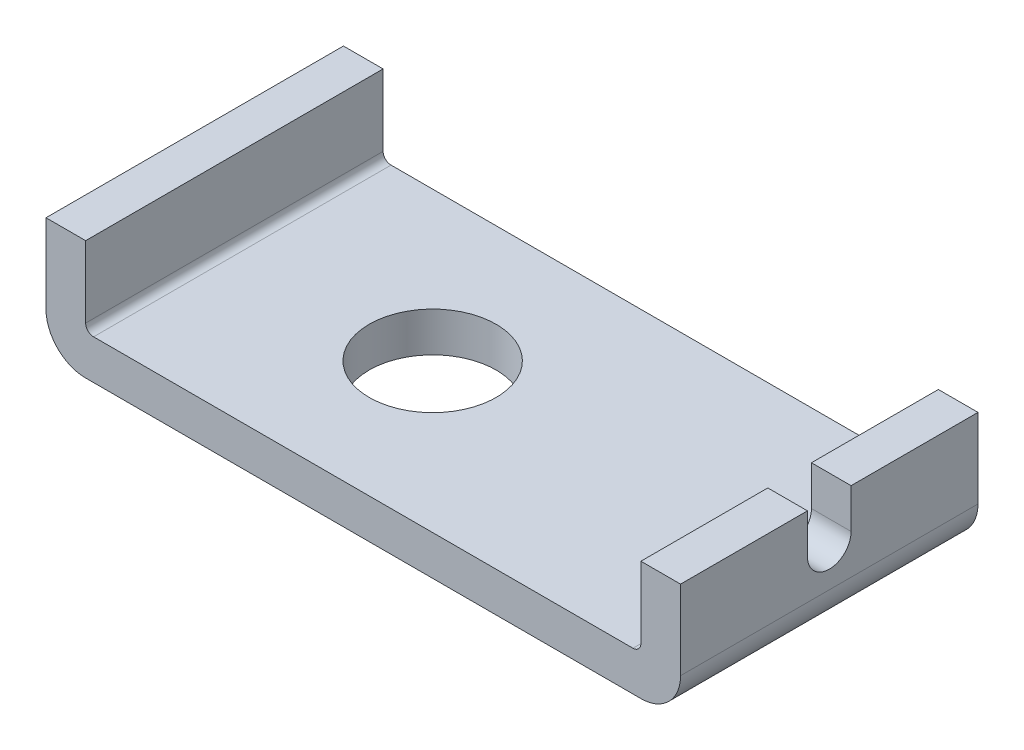
ISO-10303-21;
HEADER;
FILE_DESCRIPTION(('STEP AP214'),'2;1');
FILE_NAME('part.step','',(''),(''),'','','');
FILE_SCHEMA(('AUTOMOTIVE_DESIGN { 1 0 10303 214 1 1 1 1 }'));
ENDSEC;
DATA;
#1=APPLICATION_CONTEXT('core data for automotive mechanical design processes');
#2=APPLICATION_PROTOCOL_DEFINITION('international standard','automotive_design',2000,#1);
#3=PRODUCT_CONTEXT('',#1,'mechanical');
#4=PRODUCT('Part','Part','',(#3));
#5=PRODUCT_RELATED_PRODUCT_CATEGORY('part','',(#4));
#6=PRODUCT_DEFINITION_FORMATION('','',#4);
#7=PRODUCT_DEFINITION_CONTEXT('part definition',#1,'design');
#8=PRODUCT_DEFINITION('design','',#6,#7);
#9=PRODUCT_DEFINITION_SHAPE('','',#8);
#10=(LENGTH_UNIT() NAMED_UNIT(*) SI_UNIT(.MILLI.,.METRE.));
#11=(NAMED_UNIT(*) PLANE_ANGLE_UNIT() SI_UNIT($,.RADIAN.));
#12=(NAMED_UNIT(*) SI_UNIT($,.STERADIAN.) SOLID_ANGLE_UNIT());
#13=UNCERTAINTY_MEASURE_WITH_UNIT(LENGTH_MEASURE(1.E-05),#10,'distance_accuracy_value','');
#14=(GEOMETRIC_REPRESENTATION_CONTEXT(3) GLOBAL_UNCERTAINTY_ASSIGNED_CONTEXT((#13)) GLOBAL_UNIT_ASSIGNED_CONTEXT((#10,
#11,#12)) REPRESENTATION_CONTEXT('',''));
#15=CARTESIAN_POINT('',(0.,0.,0.));
#16=DIRECTION('',(0.,0.,1.));
#17=DIRECTION('',(1.,0.,0.));
#18=AXIS2_PLACEMENT_3D('',#15,#16,#17);
#19=CARTESIAN_POINT('',(58.4832904884319,34.7557840616967,-37.5));
#20=DIRECTION('',(0.,1.,0.));
#21=DIRECTION('',(0.,0.,1.));
#22=AXIS2_PLACEMENT_3D('',#19,#20,#21);
#23=PLANE('',#22);
#24=DIRECTION('',(1.,0.,0.));
#25=VECTOR('',#24,1.);
#26=CARTESIAN_POINT('',(58.4832904884319,34.7557840616967,5.5));
#27=LINE('',#26,#25);
#28=CARTESIAN_POINT('',(58.4832904884319,34.7557840616967,5.5));
#29=VERTEX_POINT('',#28);
#30=CARTESIAN_POINT('',(68.4832904884319,34.7557840616967,5.5));
#31=VERTEX_POINT('',#30);
#32=EDGE_CURVE('E270',#29,#31,#27,.T.);
#33=ORIENTED_EDGE('',*,*,#32,.F.);
#34=DIRECTION('',(0.,0.,1.));
#35=VECTOR('',#34,1.);
#36=CARTESIAN_POINT('',(58.4832904884319,34.7557840616967,-37.5));
#37=LINE('',#36,#35);
#38=CARTESIAN_POINT('',(58.4832904884319,34.7557840616967,37.5));
#39=VERTEX_POINT('',#38);
#40=EDGE_CURVE('E214',#29,#39,#37,.T.);
#41=ORIENTED_EDGE('',*,*,#40,.T.);
#42=DIRECTION('',(-1.,0.,0.));
#43=VECTOR('',#42,1.);
#44=CARTESIAN_POINT('',(58.4832904884319,34.7557840616967,37.5));
#45=LINE('',#44,#43);
#46=CARTESIAN_POINT('',(68.4832904884319,34.7557840616967,37.5));
#47=VERTEX_POINT('',#46);
#48=EDGE_CURVE('E186',#47,#39,#45,.T.);
#49=ORIENTED_EDGE('',*,*,#48,.F.);
#50=DIRECTION('',(0.,0.,1.));
#51=VECTOR('',#50,1.);
#52=CARTESIAN_POINT('',(68.4832904884319,34.7557840616967,-37.5));
#53=LINE('',#52,#51);
#54=EDGE_CURVE('E218',#31,#47,#53,.T.);
#55=ORIENTED_EDGE('',*,*,#54,.F.);
#56=EDGE_LOOP('',(#33,#41,#49,#55));
#57=FACE_BOUND('',#56,.T.);
#58=ADVANCED_FACE('F35',(#57),#23,.T.);
#59=CARTESIAN_POINT('',(-91.5167095115682,34.7557840616967,-37.5));
#60=DIRECTION('',(-1.,0.,0.));
#61=DIRECTION('',(0.,-1.,0.));
#62=AXIS2_PLACEMENT_3D('',#59,#60,#61);
#63=PLANE('',#62);
#64=DIRECTION('',(0.,-1.,0.));
#65=VECTOR('',#64,1.);
#66=CARTESIAN_POINT('',(-91.5167095115682,34.7557840616967,37.5));
#67=LINE('',#66,#65);
#68=CARTESIAN_POINT('',(-91.5167095115682,34.7557840616967,37.5));
#69=VERTEX_POINT('',#68);
#70=CARTESIAN_POINT('',(-91.5167095115681,14.7557840616967,37.5));
#71=VERTEX_POINT('',#70);
#72=EDGE_CURVE('E170',#69,#71,#67,.T.);
#73=ORIENTED_EDGE('',*,*,#72,.F.);
#74=DIRECTION('',(0.,0.,1.));
#75=VECTOR('',#74,1.);
#76=CARTESIAN_POINT('',(-91.5167095115682,34.7557840616967,-37.5));
#77=LINE('',#76,#75);
#78=CARTESIAN_POINT('',(-91.5167095115682,34.7557840616967,-37.5));
#79=VERTEX_POINT('',#78);
#80=EDGE_CURVE('E11',#79,#69,#77,.T.);
#81=ORIENTED_EDGE('',*,*,#80,.F.);
#82=DIRECTION('',(0.,-1.,0.));
#83=VECTOR('',#82,1.);
#84=CARTESIAN_POINT('',(-91.5167095115682,34.7557840616967,-37.5));
#85=LINE('',#84,#83);
#86=CARTESIAN_POINT('',(-91.5167095115681,14.7557840616967,-37.5));
#87=VERTEX_POINT('',#86);
#88=EDGE_CURVE('E203',#79,#87,#85,.T.);
#89=ORIENTED_EDGE('',*,*,#88,.T.);
#90=DIRECTION('',(0.,0.,1.));
#91=VECTOR('',#90,1.);
#92=CARTESIAN_POINT('',(-91.5167095115681,14.7557840616967,-37.5));
#93=LINE('',#92,#91);
#94=EDGE_CURVE('E39',#87,#71,#93,.T.);
#95=ORIENTED_EDGE('',*,*,#94,.T.);
#96=EDGE_LOOP('',(#73,#81,#89,#95));
#97=FACE_BOUND('',#96,.T.);
#98=ADVANCED_FACE('F37',(#97),#63,.T.);
#99=CARTESIAN_POINT('',(-91.5167095115682,34.7557840616967,-37.5));
#100=DIRECTION('',(0.,1.,0.));
#101=DIRECTION('',(0.,0.,1.));
#102=AXIS2_PLACEMENT_3D('',#99,#100,#101);
#103=PLANE('',#102);
#104=DIRECTION('',(-1.,0.,0.));
#105=VECTOR('',#104,1.);
#106=CARTESIAN_POINT('',(-91.5167095115682,34.7557840616967,37.5));
#107=LINE('',#106,#105);
#108=CARTESIAN_POINT('',(-81.5167095115681,34.7557840616967,37.5));
#109=VERTEX_POINT('',#108);
#110=EDGE_CURVE('E201',#109,#69,#107,.T.);
#111=ORIENTED_EDGE('',*,*,#110,.F.);
#112=DIRECTION('',(0.,0.,1.));
#113=VECTOR('',#112,1.);
#114=CARTESIAN_POINT('',(-81.5167095115681,34.7557840616967,-37.5));
#115=LINE('',#114,#113);
#116=CARTESIAN_POINT('',(-81.5167095115681,34.7557840616967,-37.5));
#117=VERTEX_POINT('',#116);
#118=EDGE_CURVE('E44',#117,#109,#115,.T.);
#119=ORIENTED_EDGE('',*,*,#118,.F.);
#120=DIRECTION('',(-1.,0.,0.));
#121=VECTOR('',#120,1.);
#122=CARTESIAN_POINT('',(-91.5167095115682,34.7557840616967,-37.5));
#123=LINE('',#122,#121);
#124=EDGE_CURVE('E160',#117,#79,#123,.T.);
#125=ORIENTED_EDGE('',*,*,#124,.T.);
#126=ORIENTED_EDGE('',*,*,#80,.T.);
#127=EDGE_LOOP('',(#111,#119,#125,#126));
#128=FACE_BOUND('',#127,.T.);
#129=ADVANCED_FACE('F227',(#128),#103,.T.);
#130=CARTESIAN_POINT('',(-81.5167095115681,34.7557840616967,-37.5));
#131=DIRECTION('',(1.,0.,0.));
#132=DIRECTION('',(0.,0.,-1.));
#133=AXIS2_PLACEMENT_3D('',#130,#131,#132);
#134=PLANE('',#133);
#135=DIRECTION('',(0.,1.,0.));
#136=VECTOR('',#135,1.);
#137=CARTESIAN_POINT('',(-81.5167095115681,34.7557840616967,37.5));
#138=LINE('',#137,#136);
#139=CARTESIAN_POINT('',(-81.5167095115681,16.7557840616967,37.5));
#140=VERTEX_POINT('',#139);
#141=EDGE_CURVE('E147',#140,#109,#138,.T.);
#142=ORIENTED_EDGE('',*,*,#141,.F.);
#143=DIRECTION('',(0.,0.,1.));
#144=VECTOR('',#143,1.);
#145=CARTESIAN_POINT('',(-81.5167095115681,16.7557840616967,-37.5));
#146=LINE('',#145,#144);
#147=CARTESIAN_POINT('',(-81.5167095115681,16.7557840616967,-37.5));
#148=VERTEX_POINT('',#147);
#149=EDGE_CURVE('E141',#148,#140,#146,.T.);
#150=ORIENTED_EDGE('',*,*,#149,.F.);
#151=DIRECTION('',(0.,1.,0.));
#152=VECTOR('',#151,1.);
#153=CARTESIAN_POINT('',(-81.5167095115681,34.7557840616967,-37.5));
#154=LINE('',#153,#152);
#155=EDGE_CURVE('E144',#148,#117,#154,.T.);
#156=ORIENTED_EDGE('',*,*,#155,.T.);
#157=ORIENTED_EDGE('',*,*,#118,.T.);
#158=EDGE_LOOP('',(#142,#150,#156,#157));
#159=FACE_BOUND('',#158,.T.);
#160=ADVANCED_FACE('F143',(#159),#134,.T.);
#161=CARTESIAN_POINT('',(-79.5167095115681,16.7557840616967,-37.5));
#162=DIRECTION('',(0.,0.,1.));
#163=DIRECTION('',(1.,0.,0.));
#164=AXIS2_PLACEMENT_3D('',#161,#162,#163);
#165=CYLINDRICAL_SURFACE('',#164,2.);
#166=CARTESIAN_POINT('',(-79.5167095115681,16.7557840616967,37.5));
#167=DIRECTION('',(0.,0.,-1.));
#168=DIRECTION('',(-1.,0.,0.));
#169=AXIS2_PLACEMENT_3D('',#166,#167,#168);
#170=CIRCLE('',#169,2.);
#171=CARTESIAN_POINT('',(-79.5167095115681,14.7557840616967,37.5));
#172=VERTEX_POINT('',#171);
#173=EDGE_CURVE('E198',#172,#140,#170,.T.);
#174=ORIENTED_EDGE('',*,*,#173,.F.);
#175=DIRECTION('',(0.,0.,1.));
#176=VECTOR('',#175,1.);
#177=CARTESIAN_POINT('',(-79.5167095115681,14.7557840616967,-37.5));
#178=LINE('',#177,#176);
#179=CARTESIAN_POINT('',(-79.5167095115681,14.7557840616967,-37.5));
#180=VERTEX_POINT('',#179);
#181=EDGE_CURVE('E152',#180,#172,#178,.T.);
#182=ORIENTED_EDGE('',*,*,#181,.F.);
#183=CARTESIAN_POINT('',(-79.5167095115681,16.7557840616967,-37.5));
#184=DIRECTION('',(0.,0.,-1.));
#185=DIRECTION('',(-1.,0.,0.));
#186=AXIS2_PLACEMENT_3D('',#183,#184,#185);
#187=CIRCLE('',#186,2.);
#188=EDGE_CURVE('E158',#180,#148,#187,.T.);
#189=ORIENTED_EDGE('',*,*,#188,.T.);
#190=ORIENTED_EDGE('',*,*,#149,.T.);
#191=EDGE_LOOP('',(#174,#182,#189,#190));
#192=FACE_BOUND('',#191,.T.);
#193=ADVANCED_FACE('F162',(#192),#165,.F.);
#194=CARTESIAN_POINT('',(-79.5167095115681,14.7557840616967,-37.5));
#195=DIRECTION('',(0.,1.,0.));
#196=DIRECTION('',(-1.,0.,0.));
#197=AXIS2_PLACEMENT_3D('',#194,#195,#196);
#198=PLANE('',#197);
#199=CARTESIAN_POINT('',(-31.5167095115682,14.7557840616967,0.));
#200=DIRECTION('',(0.,1.,0.));
#201=DIRECTION('',(-1.,0.,0.));
#202=AXIS2_PLACEMENT_3D('',#199,#200,#201);
#203=CIRCLE('',#202,16.);
#204=CARTESIAN_POINT('',(-47.5167095115682,14.7557840616967,0.));
#205=VERTEX_POINT('',#204);
#206=EDGE_CURVE('E347',#205,#205,#203,.T.);
#207=ORIENTED_EDGE('',*,*,#206,.F.);
#208=EDGE_LOOP('',(#207));
#209=FACE_BOUND('',#208,.T.);
#210=DIRECTION('',(-1.,0.,0.));
#211=VECTOR('',#210,1.);
#212=CARTESIAN_POINT('',(-79.5167095115681,14.7557840616967,37.5));
#213=LINE('',#212,#211);
#214=CARTESIAN_POINT('',(56.4832904884319,14.7557840616967,37.5));
#215=VERTEX_POINT('',#214);
#216=EDGE_CURVE('E195',#215,#172,#213,.T.);
#217=ORIENTED_EDGE('',*,*,#216,.F.);
#218=DIRECTION('',(0.,0.,1.));
#219=VECTOR('',#218,1.);
#220=CARTESIAN_POINT('',(56.4832904884319,14.7557840616967,-37.5));
#221=LINE('',#220,#219);
#222=CARTESIAN_POINT('',(56.4832904884319,14.7557840616967,-37.5));
#223=VERTEX_POINT('',#222);
#224=EDGE_CURVE('E207',#223,#215,#221,.T.);
#225=ORIENTED_EDGE('',*,*,#224,.F.);
#226=DIRECTION('',(-1.,0.,0.));
#227=VECTOR('',#226,1.);
#228=CARTESIAN_POINT('',(-79.5167095115681,14.7557840616967,-37.5));
#229=LINE('',#228,#227);
#230=EDGE_CURVE('E163',#223,#180,#229,.T.);
#231=ORIENTED_EDGE('',*,*,#230,.T.);
#232=ORIENTED_EDGE('',*,*,#181,.T.);
#233=EDGE_LOOP('',(#217,#225,#231,#232));
#234=FACE_BOUND('',#233,.T.);
#235=ADVANCED_FACE('F335',(#209,#234),#198,.T.);
#236=CARTESIAN_POINT('',(56.4832904884319,16.7557840616967,-37.5));
#237=DIRECTION('',(0.,0.,1.));
#238=DIRECTION('',(1.,0.,0.));
#239=AXIS2_PLACEMENT_3D('',#236,#237,#238);
#240=CYLINDRICAL_SURFACE('',#239,2.);
#241=CARTESIAN_POINT('',(56.4832904884319,16.7557840616967,37.5));
#242=DIRECTION('',(0.,0.,-1.));
#243=DIRECTION('',(1.,0.,0.));
#244=AXIS2_PLACEMENT_3D('',#241,#242,#243);
#245=CIRCLE('',#244,2.);
#246=CARTESIAN_POINT('',(58.4832904884319,16.7557840616967,37.5));
#247=VERTEX_POINT('',#246);
#248=EDGE_CURVE('E192',#247,#215,#245,.T.);
#249=ORIENTED_EDGE('',*,*,#248,.F.);
#250=DIRECTION('',(0.,0.,1.));
#251=VECTOR('',#250,1.);
#252=CARTESIAN_POINT('',(58.4832904884319,16.7557840616967,-37.5));
#253=LINE('',#252,#251);
#254=CARTESIAN_POINT('',(58.4832904884319,16.7557840616967,-37.5));
#255=VERTEX_POINT('',#254);
#256=EDGE_CURVE('E209',#255,#247,#253,.T.);
#257=ORIENTED_EDGE('',*,*,#256,.F.);
#258=CARTESIAN_POINT('',(56.4832904884319,16.7557840616967,-37.5));
#259=DIRECTION('',(0.,0.,-1.));
#260=DIRECTION('',(1.,0.,0.));
#261=AXIS2_PLACEMENT_3D('',#258,#259,#260);
#262=CIRCLE('',#261,2.);
#263=EDGE_CURVE('E165',#255,#223,#262,.T.);
#264=ORIENTED_EDGE('',*,*,#263,.T.);
#265=ORIENTED_EDGE('',*,*,#224,.T.);
#266=EDGE_LOOP('',(#249,#257,#264,#265));
#267=FACE_BOUND('',#266,.T.);
#268=ADVANCED_FACE('F255',(#267),#240,.F.);
#269=CARTESIAN_POINT('',(58.4832904884319,34.7557840616967,-37.5));
#270=DIRECTION('',(-1.,0.,0.));
#271=DIRECTION('',(0.,0.,1.));
#272=AXIS2_PLACEMENT_3D('',#269,#270,#271);
#273=PLANE('',#272);
#274=DIRECTION('',(0.,-1.,0.));
#275=VECTOR('',#274,1.);
#276=CARTESIAN_POINT('',(58.4832904884319,24.7557840616967,5.5));
#277=LINE('',#276,#275);
#278=CARTESIAN_POINT('',(58.4832904884319,24.7557840616967,5.5));
#279=VERTEX_POINT('',#278);
#280=EDGE_CURVE('E307',#29,#279,#277,.T.);
#281=ORIENTED_EDGE('',*,*,#280,.T.);
#282=CARTESIAN_POINT('',(58.4832904884319,24.7557840616967,0.));
#283=DIRECTION('',(1.,0.,0.));
#284=DIRECTION('',(0.,0.,-1.));
#285=AXIS2_PLACEMENT_3D('',#282,#283,#284);
#286=CIRCLE('',#285,5.5);
#287=CARTESIAN_POINT('',(58.4832904884319,24.7557840616967,-5.5));
#288=VERTEX_POINT('',#287);
#289=EDGE_CURVE('E304',#279,#288,#286,.T.);
#290=ORIENTED_EDGE('',*,*,#289,.T.);
#291=DIRECTION('',(0.,1.,0.));
#292=VECTOR('',#291,1.);
#293=CARTESIAN_POINT('',(58.4832904884319,24.7557840616967,-5.5));
#294=LINE('',#293,#292);
#295=CARTESIAN_POINT('',(58.4832904884319,34.7557840616967,-5.5));
#296=VERTEX_POINT('',#295);
#297=EDGE_CURVE('E301',#288,#296,#294,.T.);
#298=ORIENTED_EDGE('',*,*,#297,.T.);
#299=CARTESIAN_POINT('',(58.4832904884319,34.7557840616967,-37.5));
#300=VERTEX_POINT('',#299);
#301=EDGE_CURVE('E211',#300,#296,#37,.T.);
#302=ORIENTED_EDGE('',*,*,#301,.F.);
#303=DIRECTION('',(0.,-1.,0.));
#304=VECTOR('',#303,1.);
#305=CARTESIAN_POINT('',(58.4832904884319,34.7557840616967,-37.5));
#306=LINE('',#305,#304);
#307=EDGE_CURVE('E285',#300,#255,#306,.T.);
#308=ORIENTED_EDGE('',*,*,#307,.T.);
#309=ORIENTED_EDGE('',*,*,#256,.T.);
#310=DIRECTION('',(0.,-1.,0.));
#311=VECTOR('',#310,1.);
#312=CARTESIAN_POINT('',(58.4832904884319,34.7557840616967,37.5));
#313=LINE('',#312,#311);
#314=EDGE_CURVE('E189',#39,#247,#313,.T.);
#315=ORIENTED_EDGE('',*,*,#314,.F.);
#316=ORIENTED_EDGE('',*,*,#40,.F.);
#317=EDGE_LOOP('',(#281,#290,#298,#302,#308,#309,#315,#316));
#318=FACE_BOUND('',#317,.T.);
#319=ADVANCED_FACE('F247',(#318),#273,.T.);
#320=DIRECTION('',(1.,0.,0.));
#321=VECTOR('',#320,1.);
#322=CARTESIAN_POINT('',(58.4832904884319,34.7557840616967,-5.5));
#323=LINE('',#322,#321);
#324=CARTESIAN_POINT('',(68.4832904884319,34.7557840616967,-5.5));
#325=VERTEX_POINT('',#324);
#326=EDGE_CURVE('E260',#296,#325,#323,.T.);
#327=ORIENTED_EDGE('',*,*,#326,.T.);
#328=CARTESIAN_POINT('',(68.4832904884319,34.7557840616967,-37.5));
#329=VERTEX_POINT('',#328);
#330=EDGE_CURVE('E215',#329,#325,#53,.T.);
#331=ORIENTED_EDGE('',*,*,#330,.F.);
#332=DIRECTION('',(-1.,0.,0.));
#333=VECTOR('',#332,1.);
#334=CARTESIAN_POINT('',(58.4832904884319,34.7557840616967,-37.5));
#335=LINE('',#334,#333);
#336=EDGE_CURVE('E282',#329,#300,#335,.T.);
#337=ORIENTED_EDGE('',*,*,#336,.T.);
#338=ORIENTED_EDGE('',*,*,#301,.T.);
#339=EDGE_LOOP('',(#327,#331,#337,#338));
#340=FACE_BOUND('',#339,.T.);
#341=ADVANCED_FACE('F239',(#340),#23,.T.);
#342=CARTESIAN_POINT('',(68.4832904884319,34.7557840616967,-37.5));
#343=DIRECTION('',(1.,0.,0.));
#344=DIRECTION('',(0.,0.,-1.));
#345=AXIS2_PLACEMENT_3D('',#342,#343,#344);
#346=PLANE('',#345);
#347=DIRECTION('',(0.,-1.,0.));
#348=VECTOR('',#347,1.);
#349=CARTESIAN_POINT('',(68.4832904884319,24.7557840616967,5.5));
#350=LINE('',#349,#348);
#351=CARTESIAN_POINT('',(68.4832904884319,24.7557840616967,5.5));
#352=VERTEX_POINT('',#351);
#353=EDGE_CURVE('E310',#31,#352,#350,.T.);
#354=ORIENTED_EDGE('',*,*,#353,.F.);
#355=ORIENTED_EDGE('',*,*,#54,.T.);
#356=DIRECTION('',(0.,1.,0.));
#357=VECTOR('',#356,1.);
#358=CARTESIAN_POINT('',(68.4832904884319,34.7557840616967,37.5));
#359=LINE('',#358,#357);
#360=CARTESIAN_POINT('',(68.4832904884319,14.7557840616967,37.5));
#361=VERTEX_POINT('',#360);
#362=EDGE_CURVE('E183',#361,#47,#359,.T.);
#363=ORIENTED_EDGE('',*,*,#362,.F.);
#364=DIRECTION('',(0.,0.,1.));
#365=VECTOR('',#364,1.);
#366=CARTESIAN_POINT('',(68.4832904884319,14.7557840616967,-37.5));
#367=LINE('',#366,#365);
#368=CARTESIAN_POINT('',(68.4832904884319,14.7557840616967,-37.5));
#369=VERTEX_POINT('',#368);
#370=EDGE_CURVE('E219',#369,#361,#367,.T.);
#371=ORIENTED_EDGE('',*,*,#370,.F.);
#372=DIRECTION('',(0.,1.,0.));
#373=VECTOR('',#372,1.);
#374=CARTESIAN_POINT('',(68.4832904884319,34.7557840616967,-37.5));
#375=LINE('',#374,#373);
#376=EDGE_CURVE('E278',#369,#329,#375,.T.);
#377=ORIENTED_EDGE('',*,*,#376,.T.);
#378=ORIENTED_EDGE('',*,*,#330,.T.);
#379=DIRECTION('',(0.,1.,0.));
#380=VECTOR('',#379,1.);
#381=CARTESIAN_POINT('',(68.4832904884319,24.7557840616967,-5.5));
#382=LINE('',#381,#380);
#383=CARTESIAN_POINT('',(68.4832904884319,24.7557840616967,-5.5));
#384=VERTEX_POINT('',#383);
#385=EDGE_CURVE('E276',#384,#325,#382,.T.);
#386=ORIENTED_EDGE('',*,*,#385,.F.);
#387=CARTESIAN_POINT('',(68.4832904884319,24.7557840616967,0.));
#388=DIRECTION('',(1.,0.,0.));
#389=DIRECTION('',(0.,0.,-1.));
#390=AXIS2_PLACEMENT_3D('',#387,#388,#389);
#391=CIRCLE('',#390,5.5);
#392=EDGE_CURVE('E52',#352,#384,#391,.T.);
#393=ORIENTED_EDGE('',*,*,#392,.F.);
#394=EDGE_LOOP('',(#354,#355,#363,#371,#377,#378,#386,#393));
#395=FACE_BOUND('',#394,.T.);
#396=ADVANCED_FACE('F246',(#395),#346,.T.);
#397=CARTESIAN_POINT('',(58.4832904884319,14.7557840616967,-37.5));
#398=DIRECTION('',(0.,0.,1.));
#399=DIRECTION('',(1.,0.,0.));
#400=AXIS2_PLACEMENT_3D('',#397,#398,#399);
#401=CYLINDRICAL_SURFACE('',#400,10.);
#402=CARTESIAN_POINT('',(58.4832904884319,14.7557840616967,37.5));
#403=DIRECTION('',(0.,0.,1.));
#404=DIRECTION('',(-1.,0.,0.));
#405=AXIS2_PLACEMENT_3D('',#402,#403,#404);
#406=CIRCLE('',#405,10.);
#407=CARTESIAN_POINT('',(58.4832904884318,4.75578406169667,37.5));
#408=VERTEX_POINT('',#407);
#409=EDGE_CURVE('E180',#408,#361,#406,.T.);
#410=ORIENTED_EDGE('',*,*,#409,.F.);
#411=DIRECTION('',(0.,0.,1.));
#412=VECTOR('',#411,1.);
#413=CARTESIAN_POINT('',(58.4832904884318,4.75578406169667,-37.5));
#414=LINE('',#413,#412);
#415=CARTESIAN_POINT('',(58.4832904884318,4.75578406169667,-37.5));
#416=VERTEX_POINT('',#415);
#417=EDGE_CURVE('E221',#416,#408,#414,.T.);
#418=ORIENTED_EDGE('',*,*,#417,.F.);
#419=CARTESIAN_POINT('',(58.4832904884319,14.7557840616967,-37.5));
#420=DIRECTION('',(0.,0.,1.));
#421=DIRECTION('',(-1.,0.,0.));
#422=AXIS2_PLACEMENT_3D('',#419,#420,#421);
#423=CIRCLE('',#422,10.);
#424=EDGE_CURVE('E283',#416,#369,#423,.T.);
#425=ORIENTED_EDGE('',*,*,#424,.T.);
#426=ORIENTED_EDGE('',*,*,#370,.T.);
#427=EDGE_LOOP('',(#410,#418,#425,#426));
#428=FACE_BOUND('',#427,.T.);
#429=ADVANCED_FACE('F253',(#428),#401,.T.);
#430=CARTESIAN_POINT('',(-81.5167095115681,4.75578406169667,-37.5));
#431=DIRECTION('',(0.,-1.,0.));
#432=DIRECTION('',(0.,0.,-1.));
#433=AXIS2_PLACEMENT_3D('',#430,#431,#432);
#434=PLANE('',#433);
#435=CARTESIAN_POINT('',(-31.5167095115682,4.75578406169667,0.));
#436=DIRECTION('',(0.,1.,0.));
#437=DIRECTION('',(-1.,0.,0.));
#438=AXIS2_PLACEMENT_3D('',#435,#436,#437);
#439=CIRCLE('',#438,16.);
#440=CARTESIAN_POINT('',(-47.5167095115682,4.75578406169667,0.));
#441=VERTEX_POINT('',#440);
#442=EDGE_CURVE('E315',#441,#441,#439,.T.);
#443=ORIENTED_EDGE('',*,*,#442,.T.);
#444=EDGE_LOOP('',(#443));
#445=FACE_BOUND('',#444,.T.);
#446=DIRECTION('',(1.,0.,0.));
#447=VECTOR('',#446,1.);
#448=CARTESIAN_POINT('',(-81.5167095115681,4.75578406169667,37.5));
#449=LINE('',#448,#447);
#450=CARTESIAN_POINT('',(-81.5167095115681,4.75578406169667,37.5));
#451=VERTEX_POINT('',#450);
#452=EDGE_CURVE('E177',#451,#408,#449,.T.);
#453=ORIENTED_EDGE('',*,*,#452,.F.);
#454=DIRECTION('',(0.,0.,1.));
#455=VECTOR('',#454,1.);
#456=CARTESIAN_POINT('',(-81.5167095115681,4.75578406169667,-37.5));
#457=LINE('',#456,#455);
#458=CARTESIAN_POINT('',(-81.5167095115681,4.75578406169667,-37.5));
#459=VERTEX_POINT('',#458);
#460=EDGE_CURVE('E222',#459,#451,#457,.T.);
#461=ORIENTED_EDGE('',*,*,#460,.F.);
#462=DIRECTION('',(1.,0.,0.));
#463=VECTOR('',#462,1.);
#464=CARTESIAN_POINT('',(-81.5167095115681,4.75578406169667,-37.5));
#465=LINE('',#464,#463);
#466=EDGE_CURVE('E287',#459,#416,#465,.T.);
#467=ORIENTED_EDGE('',*,*,#466,.T.);
#468=ORIENTED_EDGE('',*,*,#417,.T.);
#469=EDGE_LOOP('',(#453,#461,#467,#468));
#470=FACE_BOUND('',#469,.T.);
#471=ADVANCED_FACE('F328',(#445,#470),#434,.T.);
#472=CARTESIAN_POINT('',(-81.5167095115681,14.7557840616967,-37.5));
#473=DIRECTION('',(0.,0.,1.));
#474=DIRECTION('',(1.,0.,0.));
#475=AXIS2_PLACEMENT_3D('',#472,#473,#474);
#476=CYLINDRICAL_SURFACE('',#475,10.);
#477=CARTESIAN_POINT('',(-81.5167095115681,14.7557840616967,37.5));
#478=DIRECTION('',(0.,0.,1.));
#479=DIRECTION('',(-1.,0.,0.));
#480=AXIS2_PLACEMENT_3D('',#477,#478,#479);
#481=CIRCLE('',#480,10.);
#482=EDGE_CURVE('E173',#71,#451,#481,.T.);
#483=ORIENTED_EDGE('',*,*,#482,.F.);
#484=ORIENTED_EDGE('',*,*,#94,.F.);
#485=CARTESIAN_POINT('',(-81.5167095115681,14.7557840616967,-37.5));
#486=DIRECTION('',(0.,0.,1.));
#487=DIRECTION('',(-1.,0.,0.));
#488=AXIS2_PLACEMENT_3D('',#485,#486,#487);
#489=CIRCLE('',#488,10.);
#490=EDGE_CURVE('E324',#87,#459,#489,.T.);
#491=ORIENTED_EDGE('',*,*,#490,.T.);
#492=ORIENTED_EDGE('',*,*,#460,.T.);
#493=EDGE_LOOP('',(#483,#484,#491,#492));
#494=FACE_BOUND('',#493,.T.);
#495=ADVANCED_FACE('F224',(#494),#476,.T.);
#496=CARTESIAN_POINT('',(-81.5167095115681,14.7557840616967,-37.5));
#497=DIRECTION('',(0.,0.,-1.));
#498=DIRECTION('',(-1.,0.,0.));
#499=AXIS2_PLACEMENT_3D('',#496,#497,#498);
#500=PLANE('',#499);
#501=ORIENTED_EDGE('',*,*,#88,.F.);
#502=ORIENTED_EDGE('',*,*,#124,.F.);
#503=ORIENTED_EDGE('',*,*,#155,.F.);
#504=ORIENTED_EDGE('',*,*,#188,.F.);
#505=ORIENTED_EDGE('',*,*,#230,.F.);
#506=ORIENTED_EDGE('',*,*,#263,.F.);
#507=ORIENTED_EDGE('',*,*,#307,.F.);
#508=ORIENTED_EDGE('',*,*,#336,.F.);
#509=ORIENTED_EDGE('',*,*,#376,.F.);
#510=ORIENTED_EDGE('',*,*,#424,.F.);
#511=ORIENTED_EDGE('',*,*,#466,.F.);
#512=ORIENTED_EDGE('',*,*,#490,.F.);
#513=EDGE_LOOP('',(#501,#502,#503,#504,#505,#506,#507,#508,#509,#510,#511,#512));
#514=FACE_BOUND('',#513,.T.);
#515=ADVANCED_FACE('F156',(#514),#500,.T.);
#516=CARTESIAN_POINT('',(-81.5167095115681,14.7557840616967,37.5));
#517=DIRECTION('',(0.,0.,-1.));
#518=DIRECTION('',(-1.,0.,0.));
#519=AXIS2_PLACEMENT_3D('',#516,#517,#518);
#520=PLANE('',#519);
#521=ORIENTED_EDGE('',*,*,#72,.T.);
#522=ORIENTED_EDGE('',*,*,#482,.T.);
#523=ORIENTED_EDGE('',*,*,#452,.T.);
#524=ORIENTED_EDGE('',*,*,#409,.T.);
#525=ORIENTED_EDGE('',*,*,#362,.T.);
#526=ORIENTED_EDGE('',*,*,#48,.T.);
#527=ORIENTED_EDGE('',*,*,#314,.T.);
#528=ORIENTED_EDGE('',*,*,#248,.T.);
#529=ORIENTED_EDGE('',*,*,#216,.T.);
#530=ORIENTED_EDGE('',*,*,#173,.T.);
#531=ORIENTED_EDGE('',*,*,#141,.T.);
#532=ORIENTED_EDGE('',*,*,#110,.T.);
#533=EDGE_LOOP('',(#521,#522,#523,#524,#525,#526,#527,#528,#529,#530,#531,#532));
#534=FACE_BOUND('',#533,.T.);
#535=ADVANCED_FACE('F226',(#534),#520,.F.);
#536=CARTESIAN_POINT('',(58.4832904884319,24.7557840616967,0.));
#537=DIRECTION('',(1.,0.,0.));
#538=DIRECTION('',(0.,0.,-1.));
#539=AXIS2_PLACEMENT_3D('',#536,#537,#538);
#540=CYLINDRICAL_SURFACE('',#539,5.5);
#541=ORIENTED_EDGE('',*,*,#392,.T.);
#542=DIRECTION('',(1.,0.,0.));
#543=VECTOR('',#542,1.);
#544=CARTESIAN_POINT('',(58.4832904884319,24.7557840616967,-5.5));
#545=LINE('',#544,#543);
#546=EDGE_CURVE('E271',#288,#384,#545,.T.);
#547=ORIENTED_EDGE('',*,*,#546,.F.);
#548=ORIENTED_EDGE('',*,*,#289,.F.);
#549=DIRECTION('',(1.,0.,0.));
#550=VECTOR('',#549,1.);
#551=CARTESIAN_POINT('',(58.4832904884319,24.7557840616967,5.5));
#552=LINE('',#551,#550);
#553=EDGE_CURVE('E174',#279,#352,#552,.T.);
#554=ORIENTED_EDGE('',*,*,#553,.T.);
#555=EDGE_LOOP('',(#541,#547,#548,#554));
#556=FACE_BOUND('',#555,.T.);
#557=ADVANCED_FACE('F365',(#556),#540,.F.);
#558=CARTESIAN_POINT('',(58.4832904884319,24.7557840616967,5.5));
#559=DIRECTION('',(0.,0.,1.));
#560=DIRECTION('',(1.,0.,0.));
#561=AXIS2_PLACEMENT_3D('',#558,#559,#560);
#562=PLANE('',#561);
#563=ORIENTED_EDGE('',*,*,#353,.T.);
#564=ORIENTED_EDGE('',*,*,#553,.F.);
#565=ORIENTED_EDGE('',*,*,#280,.F.);
#566=ORIENTED_EDGE('',*,*,#32,.T.);
#567=EDGE_LOOP('',(#563,#564,#565,#566));
#568=FACE_BOUND('',#567,.T.);
#569=ADVANCED_FACE('F361',(#568),#562,.F.);
#570=CARTESIAN_POINT('',(58.4832904884319,24.7557840616967,-5.5));
#571=DIRECTION('',(0.,0.,-1.));
#572=DIRECTION('',(-1.,0.,0.));
#573=AXIS2_PLACEMENT_3D('',#570,#571,#572);
#574=PLANE('',#573);
#575=ORIENTED_EDGE('',*,*,#385,.T.);
#576=ORIENTED_EDGE('',*,*,#326,.F.);
#577=ORIENTED_EDGE('',*,*,#297,.F.);
#578=ORIENTED_EDGE('',*,*,#546,.T.);
#579=EDGE_LOOP('',(#575,#576,#577,#578));
#580=FACE_BOUND('',#579,.T.);
#581=ADVANCED_FACE('F356',(#580),#574,.F.);
#582=CARTESIAN_POINT('',(-31.5167095115682,4.75578406169667,0.));
#583=DIRECTION('',(0.,1.,0.));
#584=DIRECTION('',(-1.,0.,0.));
#585=AXIS2_PLACEMENT_3D('',#582,#583,#584);
#586=CYLINDRICAL_SURFACE('',#585,16.);
#587=ORIENTED_EDGE('',*,*,#442,.F.);
#588=EDGE_LOOP('',(#587));
#589=FACE_BOUND('',#588,.T.);
#590=ORIENTED_EDGE('',*,*,#206,.T.);
#591=EDGE_LOOP('',(#590));
#592=FACE_BOUND('',#591,.T.);
#593=ADVANCED_FACE('F354',(#589,#592),#586,.F.);
#594=CLOSED_SHELL('',(#58,#98,#129,#160,#193,#235,#268,#319,#341,#396,#429,#471,#495,#515,#535,
#557,#569,#581,#593));
#595=MANIFOLD_SOLID_BREP('B2',#594);
#596=ADVANCED_BREP_SHAPE_REPRESENTATION('',(#18,#595),#14);
#597=SHAPE_DEFINITION_REPRESENTATION(#9,#596);
ENDSEC;
END-ISO-10303-21;
